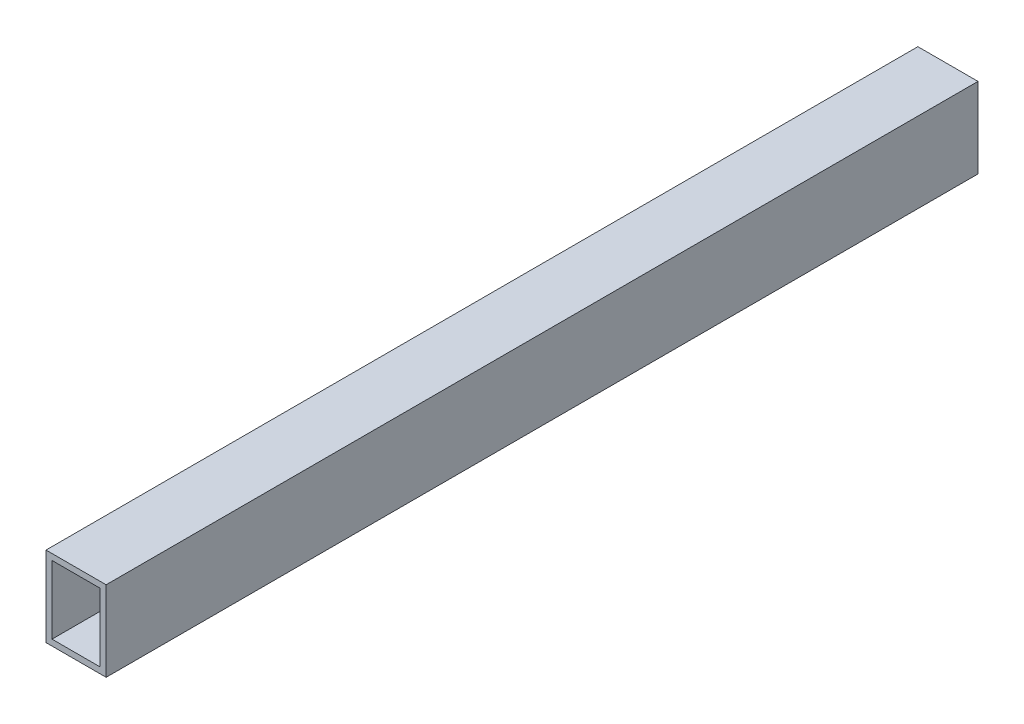
ISO-10303-21;
HEADER;
FILE_DESCRIPTION(('STEP AP214'),'2;1');
FILE_NAME('part.step','',(''),(''),'','','');
FILE_SCHEMA(('AUTOMOTIVE_DESIGN { 1 0 10303 214 1 1 1 1 }'));
ENDSEC;
DATA;
#1=APPLICATION_CONTEXT('core data for automotive mechanical design processes');
#2=APPLICATION_PROTOCOL_DEFINITION('international standard','automotive_design',2000,#1);
#3=PRODUCT_CONTEXT('',#1,'mechanical');
#4=PRODUCT('Part','Part','',(#3));
#5=PRODUCT_RELATED_PRODUCT_CATEGORY('part','',(#4));
#6=PRODUCT_DEFINITION_FORMATION('','',#4);
#7=PRODUCT_DEFINITION_CONTEXT('part definition',#1,'design');
#8=PRODUCT_DEFINITION('design','',#6,#7);
#9=PRODUCT_DEFINITION_SHAPE('','',#8);
#10=(LENGTH_UNIT() NAMED_UNIT(*) SI_UNIT(.MILLI.,.METRE.));
#11=(NAMED_UNIT(*) PLANE_ANGLE_UNIT() SI_UNIT($,.RADIAN.));
#12=(NAMED_UNIT(*) SI_UNIT($,.STERADIAN.) SOLID_ANGLE_UNIT());
#13=UNCERTAINTY_MEASURE_WITH_UNIT(LENGTH_MEASURE(1.E-05),#10,'distance_accuracy_value','');
#14=(GEOMETRIC_REPRESENTATION_CONTEXT(3) GLOBAL_UNCERTAINTY_ASSIGNED_CONTEXT((#13)) GLOBAL_UNIT_ASSIGNED_CONTEXT((#10,
#11,#12)) REPRESENTATION_CONTEXT('',''));
#15=CARTESIAN_POINT('',(0.,0.,0.));
#16=DIRECTION('',(0.,0.,1.));
#17=DIRECTION('',(1.,0.,0.));
#18=AXIS2_PLACEMENT_3D('',#15,#16,#17);
#19=CARTESIAN_POINT('',(30.,-20.,217.5));
#20=DIRECTION('',(0.,1.,0.));
#21=DIRECTION('',(0.,0.,1.));
#22=AXIS2_PLACEMENT_3D('',#19,#20,#21);
#23=PLANE('',#22);
#24=DIRECTION('',(0.,0.,-1.));
#25=VECTOR('',#24,1.);
#26=CARTESIAN_POINT('',(0.,-20.,217.5));
#27=LINE('',#26,#25);
#28=CARTESIAN_POINT('',(0.,-20.,217.5));
#29=VERTEX_POINT('',#28);
#30=CARTESIAN_POINT('',(0.,-20.,-217.5));
#31=VERTEX_POINT('',#30);
#32=EDGE_CURVE('E134',#29,#31,#27,.T.);
#33=ORIENTED_EDGE('',*,*,#32,.T.);
#34=DIRECTION('',(-1.,0.,0.));
#35=VECTOR('',#34,1.);
#36=CARTESIAN_POINT('',(30.,-20.,-217.5));
#37=LINE('',#36,#35);
#38=CARTESIAN_POINT('',(30.,-20.,-217.5));
#39=VERTEX_POINT('',#38);
#40=EDGE_CURVE('E11',#39,#31,#37,.T.);
#41=ORIENTED_EDGE('',*,*,#40,.F.);
#42=DIRECTION('',(0.,0.,-1.));
#43=VECTOR('',#42,1.);
#44=CARTESIAN_POINT('',(30.,-20.,217.5));
#45=LINE('',#44,#43);
#46=CARTESIAN_POINT('',(30.,-20.,217.5));
#47=VERTEX_POINT('',#46);
#48=EDGE_CURVE('E135',#47,#39,#45,.T.);
#49=ORIENTED_EDGE('',*,*,#48,.F.);
#50=DIRECTION('',(-1.,0.,0.));
#51=VECTOR('',#50,1.);
#52=CARTESIAN_POINT('',(30.,-20.,217.5));
#53=LINE('',#52,#51);
#54=EDGE_CURVE('E145',#47,#29,#53,.T.);
#55=ORIENTED_EDGE('',*,*,#54,.T.);
#56=EDGE_LOOP('',(#33,#41,#49,#55));
#57=FACE_BOUND('',#56,.T.);
#58=ADVANCED_FACE('F33',(#57),#23,.F.);
#59=CARTESIAN_POINT('',(30.,-20.,-217.5));
#60=DIRECTION('',(0.,0.,1.));
#61=DIRECTION('',(1.,0.,0.));
#62=AXIS2_PLACEMENT_3D('',#59,#60,#61);
#63=PLANE('',#62);
#64=DIRECTION('',(-1.,0.,0.));
#65=VECTOR('',#64,1.);
#66=CARTESIAN_POINT('',(30.,17.,-217.5));
#67=LINE('',#66,#65);
#68=CARTESIAN_POINT('',(27.,17.,-217.5));
#69=VERTEX_POINT('',#68);
#70=CARTESIAN_POINT('',(2.99999999999999,17.,-217.5));
#71=VERTEX_POINT('',#70);
#72=EDGE_CURVE('E128',#69,#71,#67,.T.);
#73=ORIENTED_EDGE('',*,*,#72,.T.);
#74=DIRECTION('',(0.,-1.,0.));
#75=VECTOR('',#74,1.);
#76=CARTESIAN_POINT('',(3.,-20.,-217.5));
#77=LINE('',#76,#75);
#78=CARTESIAN_POINT('',(3.,-17.,-217.5));
#79=VERTEX_POINT('',#78);
#80=EDGE_CURVE('E131',#71,#79,#77,.T.);
#81=ORIENTED_EDGE('',*,*,#80,.T.);
#82=DIRECTION('',(1.,0.,0.));
#83=VECTOR('',#82,1.);
#84=CARTESIAN_POINT('',(30.,-17.,-217.5));
#85=LINE('',#84,#83);
#86=CARTESIAN_POINT('',(27.,-17.,-217.5));
#87=VERTEX_POINT('',#86);
#88=EDGE_CURVE('E123',#79,#87,#85,.T.);
#89=ORIENTED_EDGE('',*,*,#88,.T.);
#90=DIRECTION('',(0.,1.,0.));
#91=VECTOR('',#90,1.);
#92=CARTESIAN_POINT('',(27.,-20.,-217.5));
#93=LINE('',#92,#91);
#94=EDGE_CURVE('E103',#87,#69,#93,.T.);
#95=ORIENTED_EDGE('',*,*,#94,.T.);
#96=EDGE_LOOP('',(#73,#81,#89,#95));
#97=FACE_BOUND('',#96,.T.);
#98=DIRECTION('',(0.,1.,0.));
#99=VECTOR('',#98,1.);
#100=CARTESIAN_POINT('',(0.,-20.,-217.5));
#101=LINE('',#100,#99);
#102=CARTESIAN_POINT('',(0.,20.,-217.5));
#103=VERTEX_POINT('',#102);
#104=EDGE_CURVE('E148',#31,#103,#101,.T.);
#105=ORIENTED_EDGE('',*,*,#104,.T.);
#106=DIRECTION('',(-1.,0.,0.));
#107=VECTOR('',#106,1.);
#108=CARTESIAN_POINT('',(30.,20.,-217.5));
#109=LINE('',#108,#107);
#110=CARTESIAN_POINT('',(30.,20.,-217.5));
#111=VERTEX_POINT('',#110);
#112=EDGE_CURVE('E40',#111,#103,#109,.T.);
#113=ORIENTED_EDGE('',*,*,#112,.F.);
#114=DIRECTION('',(0.,1.,0.));
#115=VECTOR('',#114,1.);
#116=CARTESIAN_POINT('',(30.,-20.,-217.5));
#117=LINE('',#116,#115);
#118=EDGE_CURVE('E138',#39,#111,#117,.T.);
#119=ORIENTED_EDGE('',*,*,#118,.F.);
#120=ORIENTED_EDGE('',*,*,#40,.T.);
#121=EDGE_LOOP('',(#105,#113,#119,#120));
#122=FACE_BOUND('',#121,.T.);
#123=ADVANCED_FACE('F176',(#97,#122),#63,.F.);
#124=CARTESIAN_POINT('',(30.,20.,217.5));
#125=DIRECTION('',(0.,-1.,0.));
#126=DIRECTION('',(0.,0.,-1.));
#127=AXIS2_PLACEMENT_3D('',#124,#125,#126);
#128=PLANE('',#127);
#129=DIRECTION('',(0.,0.,1.));
#130=VECTOR('',#129,1.);
#131=CARTESIAN_POINT('',(0.,20.,217.5));
#132=LINE('',#131,#130);
#133=CARTESIAN_POINT('',(0.,20.,217.5));
#134=VERTEX_POINT('',#133);
#135=EDGE_CURVE('E150',#103,#134,#132,.T.);
#136=ORIENTED_EDGE('',*,*,#135,.T.);
#137=DIRECTION('',(-1.,0.,0.));
#138=VECTOR('',#137,1.);
#139=CARTESIAN_POINT('',(30.,20.,217.5));
#140=LINE('',#139,#138);
#141=CARTESIAN_POINT('',(30.,20.,217.5));
#142=VERTEX_POINT('',#141);
#143=EDGE_CURVE('E155',#142,#134,#140,.T.);
#144=ORIENTED_EDGE('',*,*,#143,.F.);
#145=DIRECTION('',(0.,0.,1.));
#146=VECTOR('',#145,1.);
#147=CARTESIAN_POINT('',(30.,20.,217.5));
#148=LINE('',#147,#146);
#149=EDGE_CURVE('E141',#111,#142,#148,.T.);
#150=ORIENTED_EDGE('',*,*,#149,.F.);
#151=ORIENTED_EDGE('',*,*,#112,.T.);
#152=EDGE_LOOP('',(#136,#144,#150,#151));
#153=FACE_BOUND('',#152,.T.);
#154=ADVANCED_FACE('F162',(#153),#128,.F.);
#155=CARTESIAN_POINT('',(30.,-20.,217.5));
#156=DIRECTION('',(0.,0.,-1.));
#157=DIRECTION('',(-1.,0.,0.));
#158=AXIS2_PLACEMENT_3D('',#155,#156,#157);
#159=PLANE('',#158);
#160=DIRECTION('',(1.,0.,0.));
#161=VECTOR('',#160,1.);
#162=CARTESIAN_POINT('',(3.,-17.,217.5));
#163=LINE('',#162,#161);
#164=CARTESIAN_POINT('',(3.,-17.,217.5));
#165=VERTEX_POINT('',#164);
#166=CARTESIAN_POINT('',(27.,-17.,217.5));
#167=VERTEX_POINT('',#166);
#168=EDGE_CURVE('E109',#165,#167,#163,.T.);
#169=ORIENTED_EDGE('',*,*,#168,.F.);
#170=DIRECTION('',(0.,-1.,0.));
#171=VECTOR('',#170,1.);
#172=CARTESIAN_POINT('',(3.,-17.,217.5));
#173=LINE('',#172,#171);
#174=CARTESIAN_POINT('',(2.99999999999999,17.,217.5));
#175=VERTEX_POINT('',#174);
#176=EDGE_CURVE('E55',#175,#165,#173,.T.);
#177=ORIENTED_EDGE('',*,*,#176,.F.);
#178=DIRECTION('',(-1.,0.,0.));
#179=VECTOR('',#178,1.);
#180=CARTESIAN_POINT('',(2.99999999999999,17.,217.5));
#181=LINE('',#180,#179);
#182=CARTESIAN_POINT('',(27.,17.,217.5));
#183=VERTEX_POINT('',#182);
#184=EDGE_CURVE('E116',#183,#175,#181,.T.);
#185=ORIENTED_EDGE('',*,*,#184,.F.);
#186=DIRECTION('',(0.,1.,0.));
#187=VECTOR('',#186,1.);
#188=CARTESIAN_POINT('',(27.,-17.,217.5));
#189=LINE('',#188,#187);
#190=EDGE_CURVE('E100',#167,#183,#189,.T.);
#191=ORIENTED_EDGE('',*,*,#190,.F.);
#192=EDGE_LOOP('',(#169,#177,#185,#191));
#193=FACE_BOUND('',#192,.T.);
#194=DIRECTION('',(0.,-1.,0.));
#195=VECTOR('',#194,1.);
#196=CARTESIAN_POINT('',(0.,-20.,217.5));
#197=LINE('',#196,#195);
#198=EDGE_CURVE('E139',#134,#29,#197,.T.);
#199=ORIENTED_EDGE('',*,*,#198,.T.);
#200=ORIENTED_EDGE('',*,*,#54,.F.);
#201=DIRECTION('',(0.,-1.,0.));
#202=VECTOR('',#201,1.);
#203=CARTESIAN_POINT('',(30.,-20.,217.5));
#204=LINE('',#203,#202);
#205=EDGE_CURVE('E143',#142,#47,#204,.T.);
#206=ORIENTED_EDGE('',*,*,#205,.F.);
#207=ORIENTED_EDGE('',*,*,#143,.T.);
#208=EDGE_LOOP('',(#199,#200,#206,#207));
#209=FACE_BOUND('',#208,.T.);
#210=ADVANCED_FACE('F113',(#193,#209),#159,.F.);
#211=CARTESIAN_POINT('',(30.,0.,0.));
#212=DIRECTION('',(1.,0.,0.));
#213=DIRECTION('',(0.,0.,-1.));
#214=AXIS2_PLACEMENT_3D('',#211,#212,#213);
#215=PLANE('',#214);
#216=ORIENTED_EDGE('',*,*,#48,.T.);
#217=ORIENTED_EDGE('',*,*,#118,.T.);
#218=ORIENTED_EDGE('',*,*,#149,.T.);
#219=ORIENTED_EDGE('',*,*,#205,.T.);
#220=EDGE_LOOP('',(#216,#217,#218,#219));
#221=FACE_BOUND('',#220,.T.);
#222=ADVANCED_FACE('F175',(#221),#215,.T.);
#223=CARTESIAN_POINT('',(0.,0.,0.));
#224=DIRECTION('',(1.,0.,0.));
#225=DIRECTION('',(0.,0.,-1.));
#226=AXIS2_PLACEMENT_3D('',#223,#224,#225);
#227=PLANE('',#226);
#228=ORIENTED_EDGE('',*,*,#32,.F.);
#229=ORIENTED_EDGE('',*,*,#198,.F.);
#230=ORIENTED_EDGE('',*,*,#135,.F.);
#231=ORIENTED_EDGE('',*,*,#104,.F.);
#232=EDGE_LOOP('',(#228,#229,#230,#231));
#233=FACE_BOUND('',#232,.T.);
#234=ADVANCED_FACE('F168',(#233),#227,.F.);
#235=CARTESIAN_POINT('',(3.,-17.,-672.500000000001));
#236=DIRECTION('',(-1.,0.,0.));
#237=DIRECTION('',(0.,-1.,0.));
#238=AXIS2_PLACEMENT_3D('',#235,#236,#237);
#239=PLANE('',#238);
#240=DIRECTION('',(0.,0.,1.));
#241=VECTOR('',#240,1.);
#242=CARTESIAN_POINT('',(2.99999999999999,17.,-672.500000000001));
#243=LINE('',#242,#241);
#244=EDGE_CURVE('E121',#71,#175,#243,.T.);
#245=ORIENTED_EDGE('',*,*,#244,.T.);
#246=ORIENTED_EDGE('',*,*,#176,.T.);
#247=DIRECTION('',(0.,0.,1.));
#248=VECTOR('',#247,1.);
#249=CARTESIAN_POINT('',(3.,-17.,-672.500000000001));
#250=LINE('',#249,#248);
#251=EDGE_CURVE('E106',#79,#165,#250,.T.);
#252=ORIENTED_EDGE('',*,*,#251,.F.);
#253=ORIENTED_EDGE('',*,*,#80,.F.);
#254=EDGE_LOOP('',(#245,#246,#252,#253));
#255=FACE_BOUND('',#254,.T.);
#256=ADVANCED_FACE('F189',(#255),#239,.F.);
#257=CARTESIAN_POINT('',(2.99999999999999,17.,-672.500000000001));
#258=DIRECTION('',(0.,1.,0.));
#259=DIRECTION('',(0.,0.,1.));
#260=AXIS2_PLACEMENT_3D('',#257,#258,#259);
#261=PLANE('',#260);
#262=DIRECTION('',(0.,0.,1.));
#263=VECTOR('',#262,1.);
#264=CARTESIAN_POINT('',(27.,17.,-672.500000000001));
#265=LINE('',#264,#263);
#266=EDGE_CURVE('E105',#69,#183,#265,.T.);
#267=ORIENTED_EDGE('',*,*,#266,.T.);
#268=ORIENTED_EDGE('',*,*,#184,.T.);
#269=ORIENTED_EDGE('',*,*,#244,.F.);
#270=ORIENTED_EDGE('',*,*,#72,.F.);
#271=EDGE_LOOP('',(#267,#268,#269,#270));
#272=FACE_BOUND('',#271,.T.);
#273=ADVANCED_FACE('F194',(#272),#261,.F.);
#274=CARTESIAN_POINT('',(27.,-17.,-672.500000000001));
#275=DIRECTION('',(1.,0.,0.));
#276=DIRECTION('',(0.,1.,0.));
#277=AXIS2_PLACEMENT_3D('',#274,#275,#276);
#278=PLANE('',#277);
#279=DIRECTION('',(0.,0.,1.));
#280=VECTOR('',#279,1.);
#281=CARTESIAN_POINT('',(27.,-17.,-672.500000000001));
#282=LINE('',#281,#280);
#283=EDGE_CURVE('E47',#87,#167,#282,.T.);
#284=ORIENTED_EDGE('',*,*,#283,.T.);
#285=ORIENTED_EDGE('',*,*,#190,.T.);
#286=ORIENTED_EDGE('',*,*,#266,.F.);
#287=ORIENTED_EDGE('',*,*,#94,.F.);
#288=EDGE_LOOP('',(#284,#285,#286,#287));
#289=FACE_BOUND('',#288,.T.);
#290=ADVANCED_FACE('F97',(#289),#278,.F.);
#291=CARTESIAN_POINT('',(3.,-17.,-672.500000000001));
#292=DIRECTION('',(0.,-1.,0.));
#293=DIRECTION('',(0.,0.,-1.));
#294=AXIS2_PLACEMENT_3D('',#291,#292,#293);
#295=PLANE('',#294);
#296=ORIENTED_EDGE('',*,*,#251,.T.);
#297=ORIENTED_EDGE('',*,*,#168,.T.);
#298=ORIENTED_EDGE('',*,*,#283,.F.);
#299=ORIENTED_EDGE('',*,*,#88,.F.);
#300=EDGE_LOOP('',(#296,#297,#298,#299));
#301=FACE_BOUND('',#300,.T.);
#302=ADVANCED_FACE('F110',(#301),#295,.F.);
#303=CLOSED_SHELL('',(#58,#123,#154,#210,#222,#234,#256,#273,#290,#302));
#304=MANIFOLD_SOLID_BREP('B2',#303);
#305=ADVANCED_BREP_SHAPE_REPRESENTATION('',(#18,#304),#14);
#306=SHAPE_DEFINITION_REPRESENTATION(#9,#305);
ENDSEC;
END-ISO-10303-21;
